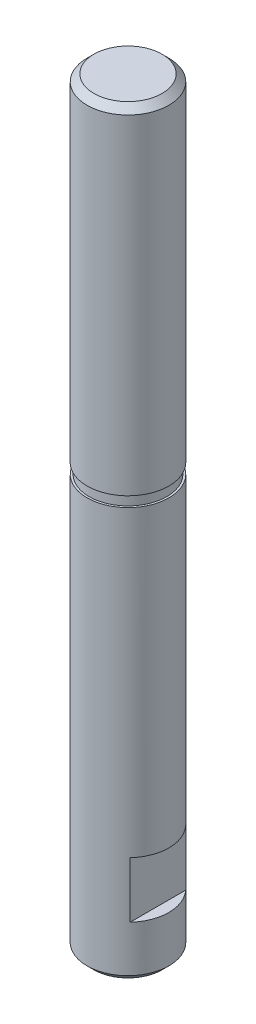
ISO-10303-21;
HEADER;
FILE_DESCRIPTION(('STEP AP214'),'2;1');
FILE_NAME('part.step','',(''),(''),'','','');
FILE_SCHEMA(('AUTOMOTIVE_DESIGN { 1 0 10303 214 1 1 1 1 }'));
ENDSEC;
DATA;
#1=APPLICATION_CONTEXT('core data for automotive mechanical design processes');
#2=APPLICATION_PROTOCOL_DEFINITION('international standard','automotive_design',2000,#1);
#3=PRODUCT_CONTEXT('',#1,'mechanical');
#4=PRODUCT('Part','Part','',(#3));
#5=PRODUCT_RELATED_PRODUCT_CATEGORY('part','',(#4));
#6=PRODUCT_DEFINITION_FORMATION('','',#4);
#7=PRODUCT_DEFINITION_CONTEXT('part definition',#1,'design');
#8=PRODUCT_DEFINITION('design','',#6,#7);
#9=PRODUCT_DEFINITION_SHAPE('','',#8);
#10=(LENGTH_UNIT() NAMED_UNIT(*) SI_UNIT(.MILLI.,.METRE.));
#11=(NAMED_UNIT(*) PLANE_ANGLE_UNIT() SI_UNIT($,.RADIAN.));
#12=(NAMED_UNIT(*) SI_UNIT($,.STERADIAN.) SOLID_ANGLE_UNIT());
#13=UNCERTAINTY_MEASURE_WITH_UNIT(LENGTH_MEASURE(1.E-05),#10,'distance_accuracy_value','');
#14=(GEOMETRIC_REPRESENTATION_CONTEXT(3) GLOBAL_UNCERTAINTY_ASSIGNED_CONTEXT((#13)) GLOBAL_UNIT_ASSIGNED_CONTEXT((#10,
#11,#12)) REPRESENTATION_CONTEXT('',''));
#15=CARTESIAN_POINT('',(0.,0.,0.));
#16=DIRECTION('',(0.,0.,1.));
#17=DIRECTION('',(1.,0.,0.));
#18=AXIS2_PLACEMENT_3D('',#15,#16,#17);
#19=CARTESIAN_POINT('',(0.,55.7,0.));
#20=DIRECTION('',(0.,-1.,0.));
#21=DIRECTION('',(0.,0.,-1.));
#22=AXIS2_PLACEMENT_3D('',#19,#20,#21);
#23=CYLINDRICAL_SURFACE('',#22,3.);
#24=CARTESIAN_POINT('',(0.,55.2,0.));
#25=DIRECTION('',(0.,1.,0.));
#26=DIRECTION('',(0.,0.,1.));
#27=AXIS2_PLACEMENT_3D('',#24,#25,#26);
#28=CIRCLE('',#27,3.);
#29=CARTESIAN_POINT('',(0.,55.2,3.));
#30=VERTEX_POINT('',#29);
#31=EDGE_CURVE('E11',#30,#30,#28,.F.);
#32=ORIENTED_EDGE('',*,*,#31,.T.);
#33=EDGE_LOOP('',(#32));
#34=FACE_BOUND('',#33,.T.);
#35=CARTESIAN_POINT('',(0.,31.,0.));
#36=DIRECTION('',(0.,1.,0.));
#37=DIRECTION('',(0.,0.,1.));
#38=AXIS2_PLACEMENT_3D('',#35,#36,#37);
#39=CIRCLE('',#38,3.);
#40=CARTESIAN_POINT('',(0.,31.,3.));
#41=VERTEX_POINT('',#40);
#42=EDGE_CURVE('E104',#41,#41,#39,.T.);
#43=ORIENTED_EDGE('',*,*,#42,.T.);
#44=EDGE_LOOP('',(#43));
#45=FACE_BOUND('',#44,.T.);
#46=ADVANCED_FACE('F41',(#34,#45),#23,.T.);
#47=CARTESIAN_POINT('',(0.,55.7,0.));
#48=DIRECTION('',(0.,1.,0.));
#49=DIRECTION('',(0.,0.,1.));
#50=AXIS2_PLACEMENT_3D('',#47,#48,#49);
#51=PLANE('',#50);
#52=CARTESIAN_POINT('',(0.,55.7,0.));
#53=DIRECTION('',(0.,1.,0.));
#54=DIRECTION('',(0.,0.,1.));
#55=AXIS2_PLACEMENT_3D('',#52,#53,#54);
#56=CIRCLE('',#55,2.5);
#57=CARTESIAN_POINT('',(0.,55.7,2.5));
#58=VERTEX_POINT('',#57);
#59=EDGE_CURVE('E50',#58,#58,#56,.T.);
#60=ORIENTED_EDGE('',*,*,#59,.T.);
#61=EDGE_LOOP('',(#60));
#62=FACE_BOUND('',#61,.T.);
#63=ADVANCED_FACE('F134',(#62),#51,.T.);
#64=CARTESIAN_POINT('',(3.,31.,0.));
#65=DIRECTION('',(0.,-1.,0.));
#66=DIRECTION('',(0.,0.,-1.));
#67=AXIS2_PLACEMENT_3D('',#64,#65,#66);
#68=PLANE('',#67);
#69=CARTESIAN_POINT('',(0.,31.,0.));
#70=DIRECTION('',(0.,1.,0.));
#71=DIRECTION('',(0.,0.,1.));
#72=AXIS2_PLACEMENT_3D('',#69,#70,#71);
#73=CIRCLE('',#72,2.85);
#74=CARTESIAN_POINT('',(0.,31.,2.85));
#75=VERTEX_POINT('',#74);
#76=EDGE_CURVE('E108',#75,#75,#73,.T.);
#77=ORIENTED_EDGE('',*,*,#76,.T.);
#78=EDGE_LOOP('',(#77));
#79=FACE_BOUND('',#78,.T.);
#80=ORIENTED_EDGE('',*,*,#42,.F.);
#81=EDGE_LOOP('',(#80));
#82=FACE_BOUND('',#81,.T.);
#83=ADVANCED_FACE('F150',(#79,#82),#68,.T.);
#84=CARTESIAN_POINT('',(0.,55.7,0.));
#85=DIRECTION('',(0.,1.,0.));
#86=DIRECTION('',(0.,0.,1.));
#87=AXIS2_PLACEMENT_3D('',#84,#85,#86);
#88=CYLINDRICAL_SURFACE('',#87,2.85);
#89=CARTESIAN_POINT('',(0.,30.25,0.));
#90=DIRECTION('',(0.,1.,0.));
#91=DIRECTION('',(0.,0.,1.));
#92=AXIS2_PLACEMENT_3D('',#89,#90,#91);
#93=CIRCLE('',#92,2.85);
#94=CARTESIAN_POINT('',(0.,30.25,2.85));
#95=VERTEX_POINT('',#94);
#96=EDGE_CURVE('E203',#95,#95,#93,.T.);
#97=ORIENTED_EDGE('',*,*,#96,.T.);
#98=EDGE_LOOP('',(#97));
#99=FACE_BOUND('',#98,.T.);
#100=ORIENTED_EDGE('',*,*,#76,.F.);
#101=EDGE_LOOP('',(#100));
#102=FACE_BOUND('',#101,.T.);
#103=ADVANCED_FACE('F189',(#99,#102),#88,.T.);
#104=CARTESIAN_POINT('',(3.,30.25,0.));
#105=DIRECTION('',(0.,1.,0.));
#106=DIRECTION('',(0.,0.,1.));
#107=AXIS2_PLACEMENT_3D('',#104,#105,#106);
#108=PLANE('',#107);
#109=CARTESIAN_POINT('',(0.,30.25,0.));
#110=DIRECTION('',(0.,1.,0.));
#111=DIRECTION('',(0.,0.,1.));
#112=AXIS2_PLACEMENT_3D('',#109,#110,#111);
#113=CIRCLE('',#112,3.);
#114=CARTESIAN_POINT('',(0.,30.25,3.));
#115=VERTEX_POINT('',#114);
#116=EDGE_CURVE('E200',#115,#115,#113,.T.);
#117=ORIENTED_EDGE('',*,*,#116,.T.);
#118=EDGE_LOOP('',(#117));
#119=FACE_BOUND('',#118,.T.);
#120=ORIENTED_EDGE('',*,*,#96,.F.);
#121=EDGE_LOOP('',(#120));
#122=FACE_BOUND('',#121,.T.);
#123=ADVANCED_FACE('F184',(#119,#122),#108,.T.);
#124=CARTESIAN_POINT('',(0.,0.,0.));
#125=DIRECTION('',(0.,1.,0.));
#126=DIRECTION('',(0.,0.,1.));
#127=AXIS2_PLACEMENT_3D('',#124,#125,#126);
#128=PLANE('',#127);
#129=CARTESIAN_POINT('',(0.,0.,0.));
#130=DIRECTION('',(0.,1.,0.));
#131=DIRECTION('',(0.,0.,1.));
#132=AXIS2_PLACEMENT_3D('',#129,#130,#131);
#133=CIRCLE('',#132,2.50000000000001);
#134=CARTESIAN_POINT('',(0.,0.,2.50000000000001));
#135=VERTEX_POINT('',#134);
#136=EDGE_CURVE('E129',#135,#135,#133,.F.);
#137=ORIENTED_EDGE('',*,*,#136,.T.);
#138=EDGE_LOOP('',(#137));
#139=FACE_BOUND('',#138,.T.);
#140=ADVANCED_FACE('F182',(#139),#128,.F.);
#141=CARTESIAN_POINT('',(-3.,3.9,-3.));
#142=DIRECTION('',(0.,-1.,0.));
#143=DIRECTION('',(1.,0.,0.));
#144=AXIS2_PLACEMENT_3D('',#141,#142,#143);
#145=PLANE('',#144);
#146=DIRECTION('',(0.,0.,1.));
#147=VECTOR('',#146,1.);
#148=CARTESIAN_POINT('',(-2.2,3.9,-3.));
#149=LINE('',#148,#147);
#150=CARTESIAN_POINT('',(-2.2,3.9,-2.03960780543711));
#151=VERTEX_POINT('',#150);
#152=CARTESIAN_POINT('',(-2.2,3.9,2.03960780543711));
#153=VERTEX_POINT('',#152);
#154=EDGE_CURVE('E56',#151,#153,#149,.T.);
#155=ORIENTED_EDGE('',*,*,#154,.F.);
#156=CARTESIAN_POINT('',(0.,3.9,0.));
#157=DIRECTION('',(0.,-1.,0.));
#158=DIRECTION('',(1.,0.,0.));
#159=AXIS2_PLACEMENT_3D('',#156,#157,#158);
#160=CIRCLE('',#159,3.);
#161=EDGE_CURVE('E113',#153,#151,#160,.T.);
#162=ORIENTED_EDGE('',*,*,#161,.F.);
#163=EDGE_LOOP('',(#155,#162));
#164=FACE_BOUND('',#163,.T.);
#165=ADVANCED_FACE('F177',(#164),#145,.F.);
#166=CARTESIAN_POINT('',(-3.,8.,-3.));
#167=DIRECTION('',(0.,1.,0.));
#168=DIRECTION('',(0.,0.,1.));
#169=AXIS2_PLACEMENT_3D('',#166,#167,#168);
#170=PLANE('',#169);
#171=DIRECTION('',(0.,0.,1.));
#172=VECTOR('',#171,1.);
#173=CARTESIAN_POINT('',(-2.2,8.,-3.));
#174=LINE('',#173,#172);
#175=CARTESIAN_POINT('',(-2.2,8.,-2.0396078054371));
#176=VERTEX_POINT('',#175);
#177=CARTESIAN_POINT('',(-2.2,8.,2.03960780543709));
#178=VERTEX_POINT('',#177);
#179=EDGE_CURVE('E111',#176,#178,#174,.T.);
#180=ORIENTED_EDGE('',*,*,#179,.T.);
#181=CARTESIAN_POINT('',(0.,8.,0.));
#182=DIRECTION('',(0.,1.,0.));
#183=DIRECTION('',(0.,0.,1.));
#184=AXIS2_PLACEMENT_3D('',#181,#182,#183);
#185=CIRCLE('',#184,3.);
#186=EDGE_CURVE('E94',#176,#178,#185,.T.);
#187=ORIENTED_EDGE('',*,*,#186,.F.);
#188=EDGE_LOOP('',(#180,#187));
#189=FACE_BOUND('',#188,.T.);
#190=ADVANCED_FACE('F174',(#189),#170,.F.);
#191=CARTESIAN_POINT('',(-2.2,8.,-3.));
#192=DIRECTION('',(1.,0.,0.));
#193=DIRECTION('',(0.,1.,0.));
#194=AXIS2_PLACEMENT_3D('',#191,#192,#193);
#195=PLANE('',#194);
#196=ORIENTED_EDGE('',*,*,#179,.F.);
#197=DIRECTION('',(0.,-1.,0.));
#198=VECTOR('',#197,1.);
#199=CARTESIAN_POINT('',(-2.20000000000002,55.7,-2.0396078054371));
#200=LINE('',#199,#198);
#201=EDGE_CURVE('E117',#151,#176,#200,.F.);
#202=ORIENTED_EDGE('',*,*,#201,.F.);
#203=ORIENTED_EDGE('',*,*,#154,.T.);
#204=DIRECTION('',(0.,-1.,0.));
#205=VECTOR('',#204,1.);
#206=CARTESIAN_POINT('',(-2.20000000000002,55.7,2.0396078054371));
#207=LINE('',#206,#205);
#208=EDGE_CURVE('E63',#178,#153,#207,.T.);
#209=ORIENTED_EDGE('',*,*,#208,.F.);
#210=EDGE_LOOP('',(#196,#202,#203,#209));
#211=FACE_BOUND('',#210,.T.);
#212=ADVANCED_FACE('F173',(#211),#195,.F.);
#213=CARTESIAN_POINT('',(3.,8.,-3.));
#214=DIRECTION('',(0.,-1.,0.));
#215=DIRECTION('',(0.,0.,-1.));
#216=AXIS2_PLACEMENT_3D('',#213,#214,#215);
#217=PLANE('',#216);
#218=DIRECTION('',(0.,0.,1.));
#219=VECTOR('',#218,1.);
#220=CARTESIAN_POINT('',(2.2,8.,-3.));
#221=LINE('',#220,#219);
#222=CARTESIAN_POINT('',(2.2,8.,-2.03960780543711));
#223=VERTEX_POINT('',#222);
#224=CARTESIAN_POINT('',(2.2,8.,2.03960780543711));
#225=VERTEX_POINT('',#224);
#226=EDGE_CURVE('E99',#223,#225,#221,.T.);
#227=ORIENTED_EDGE('',*,*,#226,.F.);
#228=CARTESIAN_POINT('',(0.,8.,0.));
#229=DIRECTION('',(0.,-1.,0.));
#230=DIRECTION('',(0.,0.,-1.));
#231=AXIS2_PLACEMENT_3D('',#228,#229,#230);
#232=CIRCLE('',#231,3.);
#233=EDGE_CURVE('E84',#223,#225,#232,.T.);
#234=ORIENTED_EDGE('',*,*,#233,.T.);
#235=EDGE_LOOP('',(#227,#234));
#236=FACE_BOUND('',#235,.T.);
#237=ADVANCED_FACE('F103',(#236),#217,.T.);
#238=CARTESIAN_POINT('',(2.2,8.,-3.));
#239=DIRECTION('',(1.,0.,0.));
#240=DIRECTION('',(0.,1.,0.));
#241=AXIS2_PLACEMENT_3D('',#238,#239,#240);
#242=PLANE('',#241);
#243=DIRECTION('',(0.,-1.,0.));
#244=VECTOR('',#243,1.);
#245=CARTESIAN_POINT('',(2.20000000000002,55.7,2.0396078054371));
#246=LINE('',#245,#244);
#247=CARTESIAN_POINT('',(2.2,3.9,2.03960780543709));
#248=VERTEX_POINT('',#247);
#249=EDGE_CURVE('E90',#225,#248,#246,.T.);
#250=ORIENTED_EDGE('',*,*,#249,.T.);
#251=DIRECTION('',(0.,0.,1.));
#252=VECTOR('',#251,1.);
#253=CARTESIAN_POINT('',(2.2,3.9,-3.));
#254=LINE('',#253,#252);
#255=CARTESIAN_POINT('',(2.2,3.9,-2.0396078054371));
#256=VERTEX_POINT('',#255);
#257=EDGE_CURVE('E101',#256,#248,#254,.T.);
#258=ORIENTED_EDGE('',*,*,#257,.F.);
#259=DIRECTION('',(0.,-1.,0.));
#260=VECTOR('',#259,1.);
#261=CARTESIAN_POINT('',(2.20000000000002,55.7,-2.0396078054371));
#262=LINE('',#261,#260);
#263=EDGE_CURVE('E88',#256,#223,#262,.F.);
#264=ORIENTED_EDGE('',*,*,#263,.T.);
#265=ORIENTED_EDGE('',*,*,#226,.T.);
#266=EDGE_LOOP('',(#250,#258,#264,#265));
#267=FACE_BOUND('',#266,.T.);
#268=ADVANCED_FACE('F98',(#267),#242,.T.);
#269=CARTESIAN_POINT('',(3.,3.9,-3.));
#270=DIRECTION('',(0.,1.,0.));
#271=DIRECTION('',(-1.,0.,0.));
#272=AXIS2_PLACEMENT_3D('',#269,#270,#271);
#273=PLANE('',#272);
#274=ORIENTED_EDGE('',*,*,#257,.T.);
#275=CARTESIAN_POINT('',(0.,3.9,0.));
#276=DIRECTION('',(0.,1.,0.));
#277=DIRECTION('',(-1.,0.,0.));
#278=AXIS2_PLACEMENT_3D('',#275,#276,#277);
#279=CIRCLE('',#278,3.);
#280=EDGE_CURVE('E124',#248,#256,#279,.T.);
#281=ORIENTED_EDGE('',*,*,#280,.T.);
#282=EDGE_LOOP('',(#274,#281));
#283=FACE_BOUND('',#282,.T.);
#284=ADVANCED_FACE('F155',(#283),#273,.T.);
#285=CARTESIAN_POINT('',(0.,0.499999999999994,0.));
#286=DIRECTION('',(0.,1.,0.));
#287=DIRECTION('',(0.,0.,1.));
#288=AXIS2_PLACEMENT_3D('',#285,#286,#287);
#289=CIRCLE('',#288,3.);
#290=CARTESIAN_POINT('',(0.,0.499999999999994,3.));
#291=VERTEX_POINT('',#290);
#292=EDGE_CURVE('E126',#291,#291,#289,.T.);
#293=ORIENTED_EDGE('',*,*,#292,.T.);
#294=EDGE_LOOP('',(#293));
#295=FACE_BOUND('',#294,.T.);
#296=ORIENTED_EDGE('',*,*,#280,.F.);
#297=ORIENTED_EDGE('',*,*,#249,.F.);
#298=ORIENTED_EDGE('',*,*,#233,.F.);
#299=ORIENTED_EDGE('',*,*,#263,.F.);
#300=EDGE_LOOP('',(#296,#297,#298,#299));
#301=FACE_BOUND('',#300,.T.);
#302=ORIENTED_EDGE('',*,*,#201,.T.);
#303=ORIENTED_EDGE('',*,*,#186,.T.);
#304=ORIENTED_EDGE('',*,*,#208,.T.);
#305=ORIENTED_EDGE('',*,*,#161,.T.);
#306=EDGE_LOOP('',(#302,#303,#304,#305));
#307=FACE_BOUND('',#306,.T.);
#308=ORIENTED_EDGE('',*,*,#116,.F.);
#309=EDGE_LOOP('',(#308));
#310=FACE_BOUND('',#309,.T.);
#311=ADVANCED_FACE('F86',(#295,#301,#307,#310),#23,.T.);
#312=CARTESIAN_POINT('',(0.,0.499999999999994,0.));
#313=DIRECTION('',(0.,1.,0.));
#314=DIRECTION('',(0.,0.,1.));
#315=AXIS2_PLACEMENT_3D('',#312,#313,#314);
#316=CONICAL_SURFACE('',#315,3.,0.785398163397446);
#317=ORIENTED_EDGE('',*,*,#136,.F.);
#318=EDGE_LOOP('',(#317));
#319=FACE_BOUND('',#318,.T.);
#320=ORIENTED_EDGE('',*,*,#292,.F.);
#321=EDGE_LOOP('',(#320));
#322=FACE_BOUND('',#321,.T.);
#323=ADVANCED_FACE('F137',(#319,#322),#316,.T.);
#324=CARTESIAN_POINT('',(0.,55.7,0.));
#325=DIRECTION('',(0.,-1.,0.));
#326=DIRECTION('',(0.,0.,-1.));
#327=AXIS2_PLACEMENT_3D('',#324,#325,#326);
#328=CONICAL_SURFACE('',#327,2.5,0.785398163397446);
#329=ORIENTED_EDGE('',*,*,#31,.F.);
#330=EDGE_LOOP('',(#329));
#331=FACE_BOUND('',#330,.T.);
#332=ORIENTED_EDGE('',*,*,#59,.F.);
#333=EDGE_LOOP('',(#332));
#334=FACE_BOUND('',#333,.T.);
#335=ADVANCED_FACE('F44',(#331,#334),#328,.T.);
#336=CLOSED_SHELL('',(#46,#63,#83,#103,#123,#140,#165,#190,#212,#237,#268,#284,#311,#323,#335));
#337=MANIFOLD_SOLID_BREP('B2',#336);
#338=ADVANCED_BREP_SHAPE_REPRESENTATION('',(#18,#337),#14);
#339=SHAPE_DEFINITION_REPRESENTATION(#9,#338);
ENDSEC;
END-ISO-10303-21;
